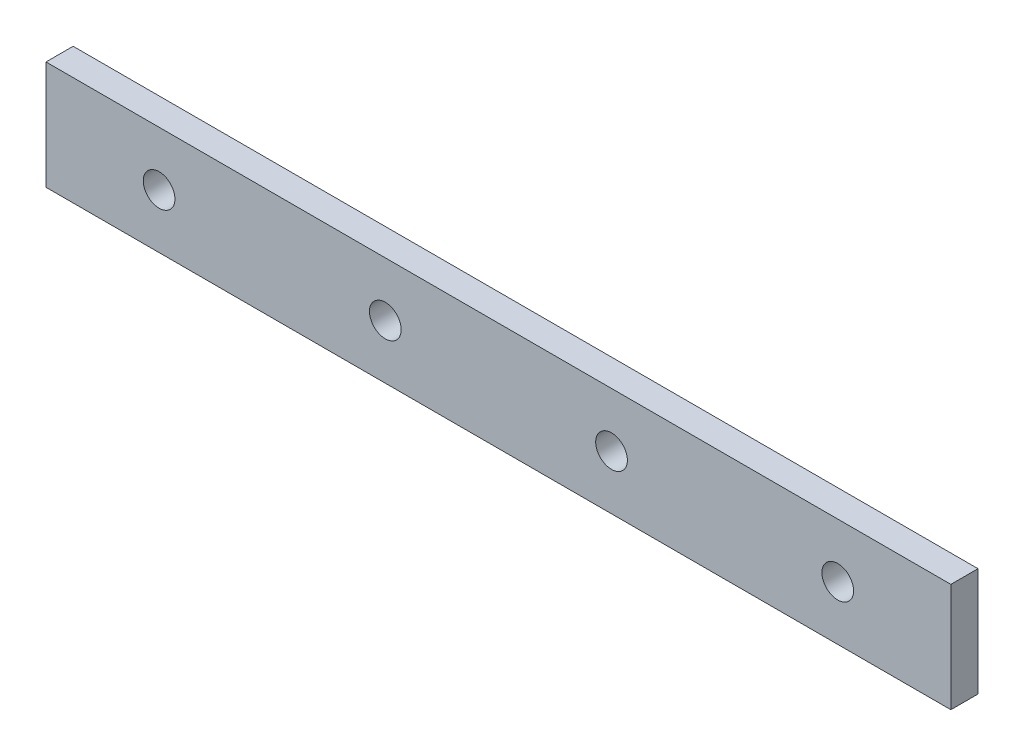
ISO-10303-21;
HEADER;
FILE_DESCRIPTION(('STEP AP214'),'2;1');
FILE_NAME('part.step','',(''),(''),'','','');
FILE_SCHEMA(('AUTOMOTIVE_DESIGN { 1 0 10303 214 1 1 1 1 }'));
ENDSEC;
DATA;
#1=APPLICATION_CONTEXT('core data for automotive mechanical design processes');
#2=APPLICATION_PROTOCOL_DEFINITION('international standard','automotive_design',2000,#1);
#3=PRODUCT_CONTEXT('',#1,'mechanical');
#4=PRODUCT('Part','Part','',(#3));
#5=PRODUCT_RELATED_PRODUCT_CATEGORY('part','',(#4));
#6=PRODUCT_DEFINITION_FORMATION('','',#4);
#7=PRODUCT_DEFINITION_CONTEXT('part definition',#1,'design');
#8=PRODUCT_DEFINITION('design','',#6,#7);
#9=PRODUCT_DEFINITION_SHAPE('','',#8);
#10=(LENGTH_UNIT() NAMED_UNIT(*) SI_UNIT(.MILLI.,.METRE.));
#11=(NAMED_UNIT(*) PLANE_ANGLE_UNIT() SI_UNIT($,.RADIAN.));
#12=(NAMED_UNIT(*) SI_UNIT($,.STERADIAN.) SOLID_ANGLE_UNIT());
#13=UNCERTAINTY_MEASURE_WITH_UNIT(LENGTH_MEASURE(1.E-05),#10,'distance_accuracy_value','');
#14=(GEOMETRIC_REPRESENTATION_CONTEXT(3) GLOBAL_UNCERTAINTY_ASSIGNED_CONTEXT((#13)) GLOBAL_UNIT_ASSIGNED_CONTEXT((#10,
#11,#12)) REPRESENTATION_CONTEXT('',''));
#15=CARTESIAN_POINT('',(0.,0.,0.));
#16=DIRECTION('',(0.,0.,1.));
#17=DIRECTION('',(1.,0.,0.));
#18=AXIS2_PLACEMENT_3D('',#15,#16,#17);
#19=CARTESIAN_POINT('',(-37.5,0.,0.));
#20=DIRECTION('',(0.,0.,1.));
#21=DIRECTION('',(1.,0.,0.));
#22=AXIS2_PLACEMENT_3D('',#19,#20,#21);
#23=CYLINDRICAL_SURFACE('',#22,1.75);
#24=CARTESIAN_POINT('',(-37.5,0.,0.));
#25=DIRECTION('',(0.,0.,1.));
#26=DIRECTION('',(1.,0.,0.));
#27=AXIS2_PLACEMENT_3D('',#24,#25,#26);
#28=CIRCLE('',#27,1.75);
#29=CARTESIAN_POINT('',(-35.75,0.,0.));
#30=VERTEX_POINT('',#29);
#31=EDGE_CURVE('E41',#30,#30,#28,.T.);
#32=ORIENTED_EDGE('',*,*,#31,.F.);
#33=EDGE_LOOP('',(#32));
#34=FACE_BOUND('',#33,.T.);
#35=CARTESIAN_POINT('',(-37.5,0.,3.));
#36=DIRECTION('',(0.,0.,1.));
#37=DIRECTION('',(1.,0.,0.));
#38=AXIS2_PLACEMENT_3D('',#35,#36,#37);
#39=CIRCLE('',#38,1.75);
#40=CARTESIAN_POINT('',(-35.75,0.,3.));
#41=VERTEX_POINT('',#40);
#42=EDGE_CURVE('E11',#41,#41,#39,.T.);
#43=ORIENTED_EDGE('',*,*,#42,.T.);
#44=EDGE_LOOP('',(#43));
#45=FACE_BOUND('',#44,.T.);
#46=ADVANCED_FACE('F33',(#34,#45),#23,.F.);
#47=CARTESIAN_POINT('',(-12.5,0.,0.));
#48=DIRECTION('',(0.,0.,1.));
#49=DIRECTION('',(1.,0.,0.));
#50=AXIS2_PLACEMENT_3D('',#47,#48,#49);
#51=CYLINDRICAL_SURFACE('',#50,1.75);
#52=CARTESIAN_POINT('',(-12.5,0.,0.));
#53=DIRECTION('',(0.,0.,1.));
#54=DIRECTION('',(1.,0.,0.));
#55=AXIS2_PLACEMENT_3D('',#52,#53,#54);
#56=CIRCLE('',#55,1.75);
#57=CARTESIAN_POINT('',(-10.75,0.,0.));
#58=VERTEX_POINT('',#57);
#59=EDGE_CURVE('E112',#58,#58,#56,.T.);
#60=ORIENTED_EDGE('',*,*,#59,.F.);
#61=EDGE_LOOP('',(#60));
#62=FACE_BOUND('',#61,.T.);
#63=CARTESIAN_POINT('',(-12.5,0.,3.));
#64=DIRECTION('',(0.,0.,1.));
#65=DIRECTION('',(1.,0.,0.));
#66=AXIS2_PLACEMENT_3D('',#63,#64,#65);
#67=CIRCLE('',#66,1.75);
#68=CARTESIAN_POINT('',(-10.75,0.,3.));
#69=VERTEX_POINT('',#68);
#70=EDGE_CURVE('E117',#69,#69,#67,.T.);
#71=ORIENTED_EDGE('',*,*,#70,.T.);
#72=EDGE_LOOP('',(#71));
#73=FACE_BOUND('',#72,.T.);
#74=ADVANCED_FACE('F126',(#62,#73),#51,.F.);
#75=CARTESIAN_POINT('',(-50.,-6.,3.));
#76=DIRECTION('',(-1.,0.,0.));
#77=DIRECTION('',(0.,0.,1.));
#78=AXIS2_PLACEMENT_3D('',#75,#76,#77);
#79=PLANE('',#78);
#80=DIRECTION('',(0.,1.,0.));
#81=VECTOR('',#80,1.);
#82=CARTESIAN_POINT('',(-50.,-6.,0.));
#83=LINE('',#82,#81);
#84=CARTESIAN_POINT('',(-50.,-6.,0.));
#85=VERTEX_POINT('',#84);
#86=CARTESIAN_POINT('',(-50.,6.,0.));
#87=VERTEX_POINT('',#86);
#88=EDGE_CURVE('E103',#85,#87,#83,.T.);
#89=ORIENTED_EDGE('',*,*,#88,.F.);
#90=DIRECTION('',(0.,0.,-1.));
#91=VECTOR('',#90,1.);
#92=CARTESIAN_POINT('',(-50.,-6.,3.));
#93=LINE('',#92,#91);
#94=CARTESIAN_POINT('',(-50.,-6.,3.));
#95=VERTEX_POINT('',#94);
#96=EDGE_CURVE('E49',#95,#85,#93,.T.);
#97=ORIENTED_EDGE('',*,*,#96,.F.);
#98=DIRECTION('',(0.,1.,0.));
#99=VECTOR('',#98,1.);
#100=CARTESIAN_POINT('',(-50.,-6.,3.));
#101=LINE('',#100,#99);
#102=CARTESIAN_POINT('',(-50.,6.,3.));
#103=VERTEX_POINT('',#102);
#104=EDGE_CURVE('E97',#95,#103,#101,.T.);
#105=ORIENTED_EDGE('',*,*,#104,.T.);
#106=DIRECTION('',(0.,0.,-1.));
#107=VECTOR('',#106,1.);
#108=CARTESIAN_POINT('',(-50.,6.,3.));
#109=LINE('',#108,#107);
#110=EDGE_CURVE('E74',#103,#87,#109,.T.);
#111=ORIENTED_EDGE('',*,*,#110,.T.);
#112=EDGE_LOOP('',(#89,#97,#105,#111));
#113=FACE_BOUND('',#112,.T.);
#114=ADVANCED_FACE('F148',(#113),#79,.T.);
#115=CARTESIAN_POINT('',(-50.,-6.,3.));
#116=DIRECTION('',(0.,1.,0.));
#117=DIRECTION('',(0.,0.,1.));
#118=AXIS2_PLACEMENT_3D('',#115,#116,#117);
#119=PLANE('',#118);
#120=DIRECTION('',(1.,0.,0.));
#121=VECTOR('',#120,1.);
#122=CARTESIAN_POINT('',(-50.,-6.,0.));
#123=LINE('',#122,#121);
#124=CARTESIAN_POINT('',(50.,-6.,0.));
#125=VERTEX_POINT('',#124);
#126=EDGE_CURVE('E66',#85,#125,#123,.T.);
#127=ORIENTED_EDGE('',*,*,#126,.T.);
#128=DIRECTION('',(0.,0.,-1.));
#129=VECTOR('',#128,1.);
#130=CARTESIAN_POINT('',(50.,-6.,3.));
#131=LINE('',#130,#129);
#132=CARTESIAN_POINT('',(50.,-6.,3.));
#133=VERTEX_POINT('',#132);
#134=EDGE_CURVE('E94',#133,#125,#131,.T.);
#135=ORIENTED_EDGE('',*,*,#134,.F.);
#136=DIRECTION('',(1.,0.,0.));
#137=VECTOR('',#136,1.);
#138=CARTESIAN_POINT('',(-50.,-6.,3.));
#139=LINE('',#138,#137);
#140=EDGE_CURVE('E85',#95,#133,#139,.T.);
#141=ORIENTED_EDGE('',*,*,#140,.F.);
#142=ORIENTED_EDGE('',*,*,#96,.T.);
#143=EDGE_LOOP('',(#127,#135,#141,#142));
#144=FACE_BOUND('',#143,.T.);
#145=ADVANCED_FACE('F145',(#144),#119,.F.);
#146=CARTESIAN_POINT('',(50.,-6.,3.));
#147=DIRECTION('',(-1.,0.,0.));
#148=DIRECTION('',(0.,0.,1.));
#149=AXIS2_PLACEMENT_3D('',#146,#147,#148);
#150=PLANE('',#149);
#151=DIRECTION('',(0.,1.,0.));
#152=VECTOR('',#151,1.);
#153=CARTESIAN_POINT('',(50.,-6.,0.));
#154=LINE('',#153,#152);
#155=CARTESIAN_POINT('',(50.,6.,0.));
#156=VERTEX_POINT('',#155);
#157=EDGE_CURVE('E92',#125,#156,#154,.T.);
#158=ORIENTED_EDGE('',*,*,#157,.T.);
#159=DIRECTION('',(0.,0.,-1.));
#160=VECTOR('',#159,1.);
#161=CARTESIAN_POINT('',(50.,6.,3.));
#162=LINE('',#161,#160);
#163=CARTESIAN_POINT('',(50.,6.,3.));
#164=VERTEX_POINT('',#163);
#165=EDGE_CURVE('E89',#164,#156,#162,.T.);
#166=ORIENTED_EDGE('',*,*,#165,.F.);
#167=DIRECTION('',(0.,1.,0.));
#168=VECTOR('',#167,1.);
#169=CARTESIAN_POINT('',(50.,-6.,3.));
#170=LINE('',#169,#168);
#171=EDGE_CURVE('E79',#133,#164,#170,.T.);
#172=ORIENTED_EDGE('',*,*,#171,.F.);
#173=ORIENTED_EDGE('',*,*,#134,.T.);
#174=EDGE_LOOP('',(#158,#166,#172,#173));
#175=FACE_BOUND('',#174,.T.);
#176=ADVANCED_FACE('F90',(#175),#150,.F.);
#177=CARTESIAN_POINT('',(-50.,6.,3.));
#178=DIRECTION('',(0.,1.,0.));
#179=DIRECTION('',(0.,0.,1.));
#180=AXIS2_PLACEMENT_3D('',#177,#178,#179);
#181=PLANE('',#180);
#182=DIRECTION('',(1.,0.,0.));
#183=VECTOR('',#182,1.);
#184=CARTESIAN_POINT('',(-50.,6.,0.));
#185=LINE('',#184,#183);
#186=EDGE_CURVE('E106',#87,#156,#185,.T.);
#187=ORIENTED_EDGE('',*,*,#186,.F.);
#188=ORIENTED_EDGE('',*,*,#110,.F.);
#189=DIRECTION('',(1.,0.,0.));
#190=VECTOR('',#189,1.);
#191=CARTESIAN_POINT('',(-50.,6.,3.));
#192=LINE('',#191,#190);
#193=EDGE_CURVE('E84',#103,#164,#192,.T.);
#194=ORIENTED_EDGE('',*,*,#193,.T.);
#195=ORIENTED_EDGE('',*,*,#165,.T.);
#196=EDGE_LOOP('',(#187,#188,#194,#195));
#197=FACE_BOUND('',#196,.T.);
#198=ADVANCED_FACE('F96',(#197),#181,.T.);
#199=CARTESIAN_POINT('',(0.,0.,3.));
#200=DIRECTION('',(0.,0.,-1.));
#201=DIRECTION('',(-1.,0.,0.));
#202=AXIS2_PLACEMENT_3D('',#199,#200,#201);
#203=PLANE('',#202);
#204=CARTESIAN_POINT('',(12.5,0.,3.));
#205=DIRECTION('',(0.,0.,1.));
#206=DIRECTION('',(1.,0.,0.));
#207=AXIS2_PLACEMENT_3D('',#204,#205,#206);
#208=CIRCLE('',#207,1.75);
#209=CARTESIAN_POINT('',(14.25,0.,3.));
#210=VERTEX_POINT('',#209);
#211=EDGE_CURVE('E220',#210,#210,#208,.T.);
#212=ORIENTED_EDGE('',*,*,#211,.F.);
#213=EDGE_LOOP('',(#212));
#214=FACE_BOUND('',#213,.T.);
#215=CARTESIAN_POINT('',(37.5,0.,3.));
#216=DIRECTION('',(0.,0.,1.));
#217=DIRECTION('',(1.,0.,0.));
#218=AXIS2_PLACEMENT_3D('',#215,#216,#217);
#219=CIRCLE('',#218,1.75);
#220=CARTESIAN_POINT('',(39.25,0.,3.));
#221=VERTEX_POINT('',#220);
#222=EDGE_CURVE('E221',#221,#221,#219,.T.);
#223=ORIENTED_EDGE('',*,*,#222,.F.);
#224=EDGE_LOOP('',(#223));
#225=FACE_BOUND('',#224,.T.);
#226=ORIENTED_EDGE('',*,*,#104,.F.);
#227=ORIENTED_EDGE('',*,*,#140,.T.);
#228=ORIENTED_EDGE('',*,*,#171,.T.);
#229=ORIENTED_EDGE('',*,*,#193,.F.);
#230=EDGE_LOOP('',(#226,#227,#228,#229));
#231=FACE_BOUND('',#230,.T.);
#232=ORIENTED_EDGE('',*,*,#70,.F.);
#233=EDGE_LOOP('',(#232));
#234=FACE_BOUND('',#233,.T.);
#235=ORIENTED_EDGE('',*,*,#42,.F.);
#236=EDGE_LOOP('',(#235));
#237=FACE_BOUND('',#236,.T.);
#238=ADVANCED_FACE('F82',(#214,#225,#231,#234,#237),#203,.F.);
#239=CARTESIAN_POINT('',(0.,0.,0.));
#240=DIRECTION('',(0.,0.,-1.));
#241=DIRECTION('',(-1.,0.,0.));
#242=AXIS2_PLACEMENT_3D('',#239,#240,#241);
#243=PLANE('',#242);
#244=CARTESIAN_POINT('',(12.5,0.,0.));
#245=DIRECTION('',(0.,0.,1.));
#246=DIRECTION('',(1.,0.,0.));
#247=AXIS2_PLACEMENT_3D('',#244,#245,#246);
#248=CIRCLE('',#247,1.75);
#249=CARTESIAN_POINT('',(14.25,0.,0.));
#250=VERTEX_POINT('',#249);
#251=EDGE_CURVE('E218',#250,#250,#248,.T.);
#252=ORIENTED_EDGE('',*,*,#251,.T.);
#253=EDGE_LOOP('',(#252));
#254=FACE_BOUND('',#253,.T.);
#255=CARTESIAN_POINT('',(37.5,0.,0.));
#256=DIRECTION('',(0.,0.,1.));
#257=DIRECTION('',(1.,0.,0.));
#258=AXIS2_PLACEMENT_3D('',#255,#256,#257);
#259=CIRCLE('',#258,1.75);
#260=CARTESIAN_POINT('',(39.25,0.,0.));
#261=VERTEX_POINT('',#260);
#262=EDGE_CURVE('E107',#261,#261,#259,.T.);
#263=ORIENTED_EDGE('',*,*,#262,.T.);
#264=EDGE_LOOP('',(#263));
#265=FACE_BOUND('',#264,.T.);
#266=ORIENTED_EDGE('',*,*,#88,.T.);
#267=ORIENTED_EDGE('',*,*,#186,.T.);
#268=ORIENTED_EDGE('',*,*,#157,.F.);
#269=ORIENTED_EDGE('',*,*,#126,.F.);
#270=EDGE_LOOP('',(#266,#267,#268,#269));
#271=FACE_BOUND('',#270,.T.);
#272=ORIENTED_EDGE('',*,*,#59,.T.);
#273=EDGE_LOOP('',(#272));
#274=FACE_BOUND('',#273,.T.);
#275=ORIENTED_EDGE('',*,*,#31,.T.);
#276=EDGE_LOOP('',(#275));
#277=FACE_BOUND('',#276,.T.);
#278=ADVANCED_FACE('F122',(#254,#265,#271,#274,#277),#243,.T.);
#279=CARTESIAN_POINT('',(37.5,0.,0.));
#280=DIRECTION('',(0.,0.,1.));
#281=DIRECTION('',(1.,0.,0.));
#282=AXIS2_PLACEMENT_3D('',#279,#280,#281);
#283=CYLINDRICAL_SURFACE('',#282,1.75);
#284=ORIENTED_EDGE('',*,*,#262,.F.);
#285=EDGE_LOOP('',(#284));
#286=FACE_BOUND('',#285,.T.);
#287=ORIENTED_EDGE('',*,*,#222,.T.);
#288=EDGE_LOOP('',(#287));
#289=FACE_BOUND('',#288,.T.);
#290=ADVANCED_FACE('F136',(#286,#289),#283,.F.);
#291=CARTESIAN_POINT('',(12.5,0.,0.));
#292=DIRECTION('',(0.,0.,1.));
#293=DIRECTION('',(1.,0.,0.));
#294=AXIS2_PLACEMENT_3D('',#291,#292,#293);
#295=CYLINDRICAL_SURFACE('',#294,1.75);
#296=ORIENTED_EDGE('',*,*,#251,.F.);
#297=EDGE_LOOP('',(#296));
#298=FACE_BOUND('',#297,.T.);
#299=ORIENTED_EDGE('',*,*,#211,.T.);
#300=EDGE_LOOP('',(#299));
#301=FACE_BOUND('',#300,.T.);
#302=ADVANCED_FACE('F187',(#298,#301),#295,.F.);
#303=CLOSED_SHELL('',(#46,#74,#114,#145,#176,#198,#238,#278,#290,#302));
#304=MANIFOLD_SOLID_BREP('B2',#303);
#305=ADVANCED_BREP_SHAPE_REPRESENTATION('',(#18,#304),#14);
#306=SHAPE_DEFINITION_REPRESENTATION(#9,#305);
ENDSEC;
END-ISO-10303-21;
